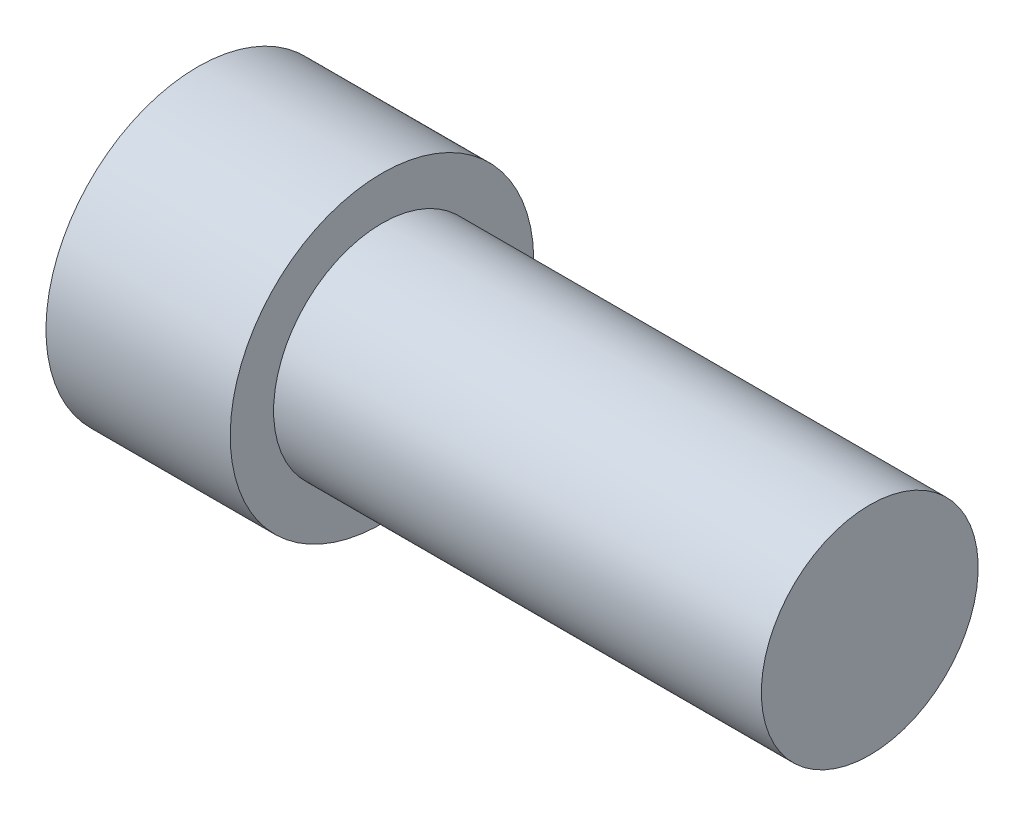
ISO-10303-21;
HEADER;
FILE_DESCRIPTION(('STEP AP214'),'2;1');
FILE_NAME('part.step','',(''),(''),'','','');
FILE_SCHEMA(('AUTOMOTIVE_DESIGN { 1 0 10303 214 1 1 1 1 }'));
ENDSEC;
DATA;
#1=APPLICATION_CONTEXT('core data for automotive mechanical design processes');
#2=APPLICATION_PROTOCOL_DEFINITION('international standard','automotive_design',2000,#1);
#3=PRODUCT_CONTEXT('',#1,'mechanical');
#4=PRODUCT('Part','Part','',(#3));
#5=PRODUCT_RELATED_PRODUCT_CATEGORY('part','',(#4));
#6=PRODUCT_DEFINITION_FORMATION('','',#4);
#7=PRODUCT_DEFINITION_CONTEXT('part definition',#1,'design');
#8=PRODUCT_DEFINITION('design','',#6,#7);
#9=PRODUCT_DEFINITION_SHAPE('','',#8);
#10=(LENGTH_UNIT() NAMED_UNIT(*) SI_UNIT(.MILLI.,.METRE.));
#11=(NAMED_UNIT(*) PLANE_ANGLE_UNIT() SI_UNIT($,.RADIAN.));
#12=(NAMED_UNIT(*) SI_UNIT($,.STERADIAN.) SOLID_ANGLE_UNIT());
#13=UNCERTAINTY_MEASURE_WITH_UNIT(LENGTH_MEASURE(1.E-05),#10,'distance_accuracy_value','');
#14=(GEOMETRIC_REPRESENTATION_CONTEXT(3) GLOBAL_UNCERTAINTY_ASSIGNED_CONTEXT((#13)) GLOBAL_UNIT_ASSIGNED_CONTEXT((#10,
#11,#12)) REPRESENTATION_CONTEXT('',''));
#15=CARTESIAN_POINT('',(0.,0.,0.));
#16=DIRECTION('',(0.,0.,1.));
#17=DIRECTION('',(1.,0.,0.));
#18=AXIS2_PLACEMENT_3D('',#15,#16,#17);
#19=CARTESIAN_POINT('',(-31.,0.28637863179463,0.));
#20=DIRECTION('',(-1.,0.,0.));
#21=DIRECTION('',(0.,-1.,0.));
#22=AXIS2_PLACEMENT_3D('',#19,#20,#21);
#23=PLANE('',#22);
#24=DIRECTION('',(0.,0.866025403784439,0.5));
#25=VECTOR('',#24,1.);
#26=CARTESIAN_POINT('',(-31.,-10.,5.77350269189626));
#27=LINE('',#26,#25);
#28=CARTESIAN_POINT('',(-31.,-10.,5.77350269189626));
#29=VERTEX_POINT('',#28);
#30=CARTESIAN_POINT('',(-31.,0.,11.5470053837925));
#31=VERTEX_POINT('',#30);
#32=EDGE_CURVE('E58',#29,#31,#27,.T.);
#33=ORIENTED_EDGE('',*,*,#32,.F.);
#34=DIRECTION('',(0.,0.,1.));
#35=VECTOR('',#34,1.);
#36=CARTESIAN_POINT('',(-31.,-10.,-5.77350269189626));
#37=LINE('',#36,#35);
#38=CARTESIAN_POINT('',(-31.,-10.,-5.77350269189626));
#39=VERTEX_POINT('',#38);
#40=EDGE_CURVE('E151',#39,#29,#37,.T.);
#41=ORIENTED_EDGE('',*,*,#40,.F.);
#42=DIRECTION('',(0.,-0.866025403784438,0.5));
#43=VECTOR('',#42,1.);
#44=CARTESIAN_POINT('',(-31.,0.,-11.5470053837925));
#45=LINE('',#44,#43);
#46=CARTESIAN_POINT('',(-31.,0.,-11.5470053837925));
#47=VERTEX_POINT('',#46);
#48=EDGE_CURVE('E148',#47,#39,#45,.T.);
#49=ORIENTED_EDGE('',*,*,#48,.F.);
#50=DIRECTION('',(0.,-0.866025403784439,-0.5));
#51=VECTOR('',#50,1.);
#52=CARTESIAN_POINT('',(-31.,10.,-5.77350269189626));
#53=LINE('',#52,#51);
#54=CARTESIAN_POINT('',(-31.,10.,-5.77350269189626));
#55=VERTEX_POINT('',#54);
#56=EDGE_CURVE('E106',#55,#47,#53,.T.);
#57=ORIENTED_EDGE('',*,*,#56,.F.);
#58=DIRECTION('',(0.,0.,-1.));
#59=VECTOR('',#58,1.);
#60=CARTESIAN_POINT('',(-31.,10.,5.77350269189625));
#61=LINE('',#60,#59);
#62=CARTESIAN_POINT('',(-31.,10.,5.77350269189625));
#63=VERTEX_POINT('',#62);
#64=EDGE_CURVE('E142',#63,#55,#61,.T.);
#65=ORIENTED_EDGE('',*,*,#64,.F.);
#66=DIRECTION('',(0.,0.866025403784438,-0.5));
#67=VECTOR('',#66,1.);
#68=CARTESIAN_POINT('',(-31.,0.,11.5470053837925));
#69=LINE('',#68,#67);
#70=EDGE_CURVE('E138',#31,#63,#69,.T.);
#71=ORIENTED_EDGE('',*,*,#70,.F.);
#72=EDGE_LOOP('',(#33,#41,#49,#57,#65,#71));
#73=FACE_BOUND('',#72,.T.);
#74=CARTESIAN_POINT('',(-31.,0.28637863179463,0.));
#75=DIRECTION('',(1.,0.,0.));
#76=DIRECTION('',(0.,1.,0.));
#77=AXIS2_PLACEMENT_3D('',#74,#75,#76);
#78=CIRCLE('',#77,14.);
#79=CARTESIAN_POINT('',(-31.,14.2863786317946,0.));
#80=VERTEX_POINT('',#79);
#81=EDGE_CURVE('E11',#80,#80,#78,.T.);
#82=ORIENTED_EDGE('',*,*,#81,.F.);
#83=EDGE_LOOP('',(#82));
#84=FACE_BOUND('',#83,.T.);
#85=ADVANCED_FACE('F43',(#73,#84),#23,.T.);
#86=CARTESIAN_POINT('',(31.,0.286378631794638,0.));
#87=DIRECTION('',(1.,0.,0.));
#88=DIRECTION('',(0.,1.,0.));
#89=AXIS2_PLACEMENT_3D('',#86,#87,#88);
#90=CYLINDRICAL_SURFACE('',#89,14.);
#91=ORIENTED_EDGE('',*,*,#81,.T.);
#92=EDGE_LOOP('',(#91));
#93=FACE_BOUND('',#92,.T.);
#94=CARTESIAN_POINT('',(-14.,0.286378631794632,0.));
#95=DIRECTION('',(1.,0.,0.));
#96=DIRECTION('',(0.,1.,0.));
#97=AXIS2_PLACEMENT_3D('',#94,#95,#96);
#98=CIRCLE('',#97,14.);
#99=CARTESIAN_POINT('',(-14.,14.2863786317946,0.));
#100=VERTEX_POINT('',#99);
#101=EDGE_CURVE('E51',#100,#100,#98,.T.);
#102=ORIENTED_EDGE('',*,*,#101,.F.);
#103=EDGE_LOOP('',(#102));
#104=FACE_BOUND('',#103,.T.);
#105=ADVANCED_FACE('F180',(#93,#104),#90,.T.);
#106=CARTESIAN_POINT('',(-14.,14.2863786317946,0.));
#107=DIRECTION('',(1.,0.,0.));
#108=DIRECTION('',(0.,1.,0.));
#109=AXIS2_PLACEMENT_3D('',#106,#107,#108);
#110=PLANE('',#109);
#111=ORIENTED_EDGE('',*,*,#101,.T.);
#112=EDGE_LOOP('',(#111));
#113=FACE_BOUND('',#112,.T.);
#114=CARTESIAN_POINT('',(-14.,0.286378631794632,0.));
#115=DIRECTION('',(1.,0.,0.));
#116=DIRECTION('',(0.,1.,0.));
#117=AXIS2_PLACEMENT_3D('',#114,#115,#116);
#118=CIRCLE('',#117,10.);
#119=CARTESIAN_POINT('',(-14.,10.2863786317946,0.));
#120=VERTEX_POINT('',#119);
#121=EDGE_CURVE('E170',#120,#120,#118,.T.);
#122=ORIENTED_EDGE('',*,*,#121,.F.);
#123=EDGE_LOOP('',(#122));
#124=FACE_BOUND('',#123,.T.);
#125=ADVANCED_FACE('F177',(#113,#124),#110,.T.);
#126=CARTESIAN_POINT('',(31.,0.286378631794638,0.));
#127=DIRECTION('',(1.,0.,0.));
#128=DIRECTION('',(0.,1.,0.));
#129=AXIS2_PLACEMENT_3D('',#126,#127,#128);
#130=CYLINDRICAL_SURFACE('',#129,10.);
#131=ORIENTED_EDGE('',*,*,#121,.T.);
#132=EDGE_LOOP('',(#131));
#133=FACE_BOUND('',#132,.T.);
#134=CARTESIAN_POINT('',(31.,0.286378631794638,0.));
#135=DIRECTION('',(1.,0.,0.));
#136=DIRECTION('',(0.,1.,0.));
#137=AXIS2_PLACEMENT_3D('',#134,#135,#136);
#138=CIRCLE('',#137,9.99999999999999);
#139=CARTESIAN_POINT('',(31.,10.2863786317946,0.));
#140=VERTEX_POINT('',#139);
#141=EDGE_CURVE('E157',#140,#140,#138,.T.);
#142=ORIENTED_EDGE('',*,*,#141,.F.);
#143=EDGE_LOOP('',(#142));
#144=FACE_BOUND('',#143,.T.);
#145=ADVANCED_FACE('F187',(#133,#144),#130,.T.);
#146=CARTESIAN_POINT('',(31.,10.2863786317946,0.));
#147=DIRECTION('',(1.,0.,0.));
#148=DIRECTION('',(0.,1.,0.));
#149=AXIS2_PLACEMENT_3D('',#146,#147,#148);
#150=PLANE('',#149);
#151=ORIENTED_EDGE('',*,*,#141,.T.);
#152=EDGE_LOOP('',(#151));
#153=FACE_BOUND('',#152,.T.);
#154=ADVANCED_FACE('F193',(#153),#150,.T.);
#155=CARTESIAN_POINT('',(-21.,-10.,5.77350269189626));
#156=DIRECTION('',(0.,-0.5,0.866025403784439));
#157=DIRECTION('',(0.,-0.866025403784439,-0.5));
#158=AXIS2_PLACEMENT_3D('',#155,#156,#157);
#159=PLANE('',#158);
#160=ORIENTED_EDGE('',*,*,#32,.T.);
#161=DIRECTION('',(-1.,0.,0.));
#162=VECTOR('',#161,1.);
#163=CARTESIAN_POINT('',(-21.,0.,11.5470053837925));
#164=LINE('',#163,#162);
#165=CARTESIAN_POINT('',(-21.,0.,11.5470053837925));
#166=VERTEX_POINT('',#165);
#167=EDGE_CURVE('E88',#166,#31,#164,.T.);
#168=ORIENTED_EDGE('',*,*,#167,.F.);
#169=DIRECTION('',(0.,0.866025403784439,0.5));
#170=VECTOR('',#169,1.);
#171=CARTESIAN_POINT('',(-21.,-10.,5.77350269189626));
#172=LINE('',#171,#170);
#173=CARTESIAN_POINT('',(-21.,-10.,5.77350269189626));
#174=VERTEX_POINT('',#173);
#175=EDGE_CURVE('E154',#174,#166,#172,.T.);
#176=ORIENTED_EDGE('',*,*,#175,.F.);
#177=DIRECTION('',(-1.,0.,0.));
#178=VECTOR('',#177,1.);
#179=CARTESIAN_POINT('',(-21.,-10.,5.77350269189626));
#180=LINE('',#179,#178);
#181=EDGE_CURVE('E66',#174,#29,#180,.T.);
#182=ORIENTED_EDGE('',*,*,#181,.T.);
#183=EDGE_LOOP('',(#160,#168,#176,#182));
#184=FACE_BOUND('',#183,.T.);
#185=ADVANCED_FACE('F197',(#184),#159,.F.);
#186=CARTESIAN_POINT('',(-21.,-10.,-5.77350269189626));
#187=DIRECTION('',(0.,-1.,0.));
#188=DIRECTION('',(1.,0.,0.));
#189=AXIS2_PLACEMENT_3D('',#186,#187,#188);
#190=PLANE('',#189);
#191=ORIENTED_EDGE('',*,*,#40,.T.);
#192=ORIENTED_EDGE('',*,*,#181,.F.);
#193=DIRECTION('',(0.,0.,1.));
#194=VECTOR('',#193,1.);
#195=CARTESIAN_POINT('',(-21.,-10.,-5.77350269189626));
#196=LINE('',#195,#194);
#197=CARTESIAN_POINT('',(-21.,-10.,-5.77350269189626));
#198=VERTEX_POINT('',#197);
#199=EDGE_CURVE('E120',#198,#174,#196,.T.);
#200=ORIENTED_EDGE('',*,*,#199,.F.);
#201=DIRECTION('',(-1.,0.,0.));
#202=VECTOR('',#201,1.);
#203=CARTESIAN_POINT('',(-21.,-10.,-5.77350269189626));
#204=LINE('',#203,#202);
#205=EDGE_CURVE('E111',#198,#39,#204,.T.);
#206=ORIENTED_EDGE('',*,*,#205,.T.);
#207=EDGE_LOOP('',(#191,#192,#200,#206));
#208=FACE_BOUND('',#207,.T.);
#209=ADVANCED_FACE('F201',(#208),#190,.F.);
#210=CARTESIAN_POINT('',(-21.,0.,-11.5470053837925));
#211=DIRECTION('',(0.,-0.5,-0.866025403784439));
#212=DIRECTION('',(0.,0.866025403784439,-0.5));
#213=AXIS2_PLACEMENT_3D('',#210,#211,#212);
#214=PLANE('',#213);
#215=ORIENTED_EDGE('',*,*,#48,.T.);
#216=ORIENTED_EDGE('',*,*,#205,.F.);
#217=DIRECTION('',(0.,-0.866025403784438,0.5));
#218=VECTOR('',#217,1.);
#219=CARTESIAN_POINT('',(-21.,0.,-11.5470053837925));
#220=LINE('',#219,#218);
#221=CARTESIAN_POINT('',(-21.,0.,-11.5470053837925));
#222=VERTEX_POINT('',#221);
#223=EDGE_CURVE('E115',#222,#198,#220,.T.);
#224=ORIENTED_EDGE('',*,*,#223,.F.);
#225=DIRECTION('',(-1.,0.,0.));
#226=VECTOR('',#225,1.);
#227=CARTESIAN_POINT('',(-21.,0.,-11.5470053837925));
#228=LINE('',#227,#226);
#229=EDGE_CURVE('E99',#222,#47,#228,.T.);
#230=ORIENTED_EDGE('',*,*,#229,.T.);
#231=EDGE_LOOP('',(#215,#216,#224,#230));
#232=FACE_BOUND('',#231,.T.);
#233=ADVANCED_FACE('F116',(#232),#214,.F.);
#234=CARTESIAN_POINT('',(-21.,10.,-5.77350269189626));
#235=DIRECTION('',(0.,0.5,-0.866025403784438));
#236=DIRECTION('',(0.,0.866025403784439,0.5));
#237=AXIS2_PLACEMENT_3D('',#234,#235,#236);
#238=PLANE('',#237);
#239=ORIENTED_EDGE('',*,*,#56,.T.);
#240=ORIENTED_EDGE('',*,*,#229,.F.);
#241=DIRECTION('',(0.,-0.866025403784439,-0.5));
#242=VECTOR('',#241,1.);
#243=CARTESIAN_POINT('',(-21.,10.,-5.77350269189626));
#244=LINE('',#243,#242);
#245=CARTESIAN_POINT('',(-21.,10.,-5.77350269189626));
#246=VERTEX_POINT('',#245);
#247=EDGE_CURVE('E103',#246,#222,#244,.T.);
#248=ORIENTED_EDGE('',*,*,#247,.F.);
#249=DIRECTION('',(-1.,0.,0.));
#250=VECTOR('',#249,1.);
#251=CARTESIAN_POINT('',(-21.,10.,-5.77350269189626));
#252=LINE('',#251,#250);
#253=EDGE_CURVE('E112',#246,#55,#252,.T.);
#254=ORIENTED_EDGE('',*,*,#253,.T.);
#255=EDGE_LOOP('',(#239,#240,#248,#254));
#256=FACE_BOUND('',#255,.T.);
#257=ADVANCED_FACE('F101',(#256),#238,.F.);
#258=CARTESIAN_POINT('',(-21.,10.,5.77350269189625));
#259=DIRECTION('',(0.,1.,0.));
#260=DIRECTION('',(-1.,0.,0.));
#261=AXIS2_PLACEMENT_3D('',#258,#259,#260);
#262=PLANE('',#261);
#263=ORIENTED_EDGE('',*,*,#64,.T.);
#264=ORIENTED_EDGE('',*,*,#253,.F.);
#265=DIRECTION('',(0.,0.,-1.));
#266=VECTOR('',#265,1.);
#267=CARTESIAN_POINT('',(-21.,10.,5.77350269189625));
#268=LINE('',#267,#266);
#269=CARTESIAN_POINT('',(-21.,10.,5.77350269189625));
#270=VERTEX_POINT('',#269);
#271=EDGE_CURVE('E126',#270,#246,#268,.T.);
#272=ORIENTED_EDGE('',*,*,#271,.F.);
#273=DIRECTION('',(-1.,0.,0.));
#274=VECTOR('',#273,1.);
#275=CARTESIAN_POINT('',(-21.,10.,5.77350269189625));
#276=LINE('',#275,#274);
#277=EDGE_CURVE('E162',#270,#63,#276,.T.);
#278=ORIENTED_EDGE('',*,*,#277,.T.);
#279=EDGE_LOOP('',(#263,#264,#272,#278));
#280=FACE_BOUND('',#279,.T.);
#281=ADVANCED_FACE('F205',(#280),#262,.F.);
#282=CARTESIAN_POINT('',(-21.,0.,11.5470053837925));
#283=DIRECTION('',(0.,0.5,0.866025403784438));
#284=DIRECTION('',(0.,-0.866025403784438,0.5));
#285=AXIS2_PLACEMENT_3D('',#282,#283,#284);
#286=PLANE('',#285);
#287=ORIENTED_EDGE('',*,*,#70,.T.);
#288=ORIENTED_EDGE('',*,*,#277,.F.);
#289=DIRECTION('',(0.,0.866025403784438,-0.5));
#290=VECTOR('',#289,1.);
#291=CARTESIAN_POINT('',(-21.,0.,11.5470053837925));
#292=LINE('',#291,#290);
#293=EDGE_CURVE('E130',#166,#270,#292,.T.);
#294=ORIENTED_EDGE('',*,*,#293,.F.);
#295=ORIENTED_EDGE('',*,*,#167,.T.);
#296=EDGE_LOOP('',(#287,#288,#294,#295));
#297=FACE_BOUND('',#296,.T.);
#298=ADVANCED_FACE('F202',(#297),#286,.F.);
#299=CARTESIAN_POINT('',(-21.,0.,0.));
#300=DIRECTION('',(-1.,0.,0.));
#301=DIRECTION('',(0.,0.,1.));
#302=AXIS2_PLACEMENT_3D('',#299,#300,#301);
#303=PLANE('',#302);
#304=ORIENTED_EDGE('',*,*,#175,.T.);
#305=ORIENTED_EDGE('',*,*,#293,.T.);
#306=ORIENTED_EDGE('',*,*,#271,.T.);
#307=ORIENTED_EDGE('',*,*,#247,.T.);
#308=ORIENTED_EDGE('',*,*,#223,.T.);
#309=ORIENTED_EDGE('',*,*,#199,.T.);
#310=EDGE_LOOP('',(#304,#305,#306,#307,#308,#309));
#311=FACE_BOUND('',#310,.T.);
#312=ADVANCED_FACE('F123',(#311),#303,.T.);
#313=CLOSED_SHELL('',(#85,#105,#125,#145,#154,#185,#209,#233,#257,#281,#298,#312));
#314=MANIFOLD_SOLID_BREP('B2',#313);
#315=ADVANCED_BREP_SHAPE_REPRESENTATION('',(#18,#314),#14);
#316=SHAPE_DEFINITION_REPRESENTATION(#9,#315);
ENDSEC;
END-ISO-10303-21;
